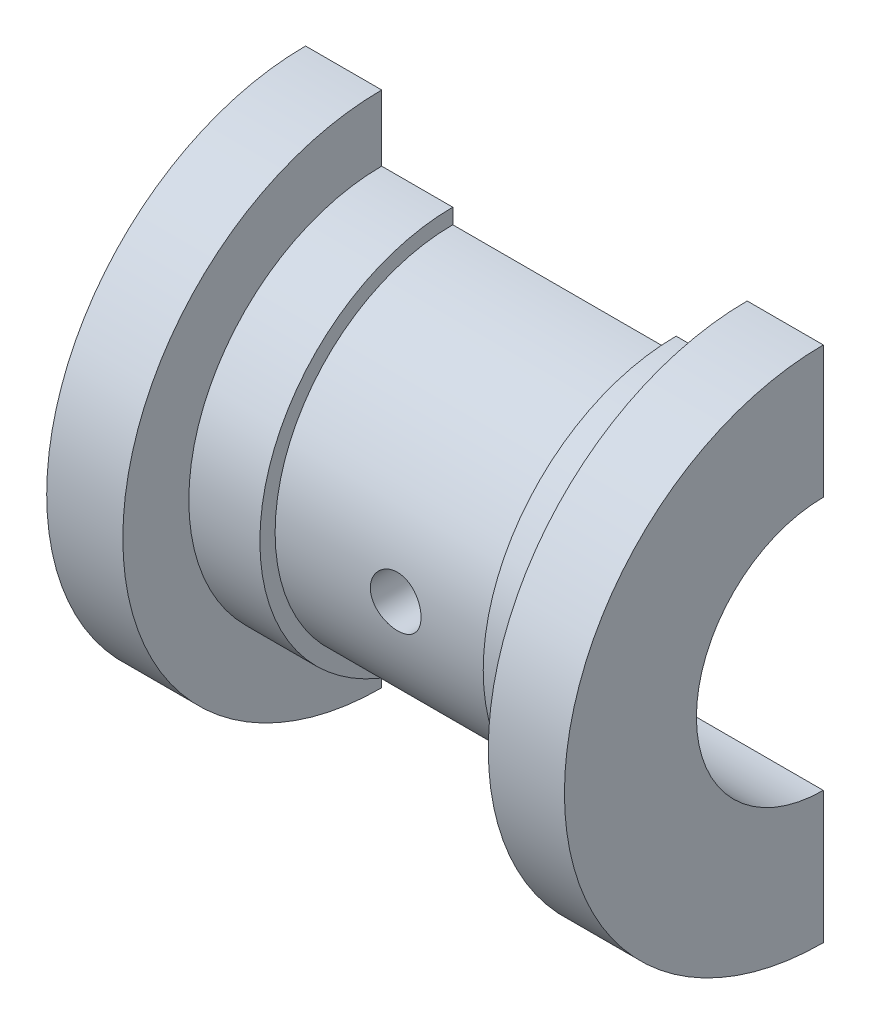
ISO-10303-21;
HEADER;
FILE_DESCRIPTION(('STEP AP214'),'2;1');
FILE_NAME('part.step','',(''),(''),'','','');
FILE_SCHEMA(('AUTOMOTIVE_DESIGN { 1 0 10303 214 1 1 1 1 }'));
ENDSEC;
DATA;
#1=APPLICATION_CONTEXT('core data for automotive mechanical design processes');
#2=APPLICATION_PROTOCOL_DEFINITION('international standard','automotive_design',2000,#1);
#3=PRODUCT_CONTEXT('',#1,'mechanical');
#4=PRODUCT('Part','Part','',(#3));
#5=PRODUCT_RELATED_PRODUCT_CATEGORY('part','',(#4));
#6=PRODUCT_DEFINITION_FORMATION('','',#4);
#7=PRODUCT_DEFINITION_CONTEXT('part definition',#1,'design');
#8=PRODUCT_DEFINITION('design','',#6,#7);
#9=PRODUCT_DEFINITION_SHAPE('','',#8);
#10=(LENGTH_UNIT() NAMED_UNIT(*) SI_UNIT(.MILLI.,.METRE.));
#11=(NAMED_UNIT(*) PLANE_ANGLE_UNIT() SI_UNIT($,.RADIAN.));
#12=(NAMED_UNIT(*) SI_UNIT($,.STERADIAN.) SOLID_ANGLE_UNIT());
#13=UNCERTAINTY_MEASURE_WITH_UNIT(LENGTH_MEASURE(1.E-05),#10,'distance_accuracy_value','');
#14=(GEOMETRIC_REPRESENTATION_CONTEXT(3) GLOBAL_UNCERTAINTY_ASSIGNED_CONTEXT((#13)) GLOBAL_UNIT_ASSIGNED_CONTEXT((#10,
#11,#12)) REPRESENTATION_CONTEXT('',''));
#15=CARTESIAN_POINT('',(0.,0.,0.));
#16=DIRECTION('',(0.,0.,1.));
#17=DIRECTION('',(1.,0.,0.));
#18=AXIS2_PLACEMENT_3D('',#15,#16,#17);
#19=CARTESIAN_POINT('',(0.,0.,0.));
#20=DIRECTION('',(0.,0.,1.));
#21=DIRECTION('',(-1.,0.,0.));
#22=AXIS2_PLACEMENT_3D('',#19,#20,#21);
#23=PLANE('',#22);
#24=DIRECTION('',(0.,-1.,0.));
#25=VECTOR('',#24,1.);
#26=CARTESIAN_POINT('',(51.,-25.5,-1.78065548281E-13));
#27=LINE('',#26,#25);
#28=CARTESIAN_POINT('',(51.,25.5,0.));
#29=VERTEX_POINT('',#28);
#30=CARTESIAN_POINT('',(51.,12.5,0.));
#31=VERTEX_POINT('',#30);
#32=EDGE_CURVE('E133',#29,#31,#27,.T.);
#33=ORIENTED_EDGE('',*,*,#32,.T.);
#34=DIRECTION('',(-1.,0.,0.));
#35=VECTOR('',#34,1.);
#36=CARTESIAN_POINT('',(51.,12.5,0.));
#37=LINE('',#36,#35);
#38=CARTESIAN_POINT('',(0.,12.5,0.));
#39=VERTEX_POINT('',#38);
#40=EDGE_CURVE('E120',#31,#39,#37,.T.);
#41=ORIENTED_EDGE('',*,*,#40,.T.);
#42=DIRECTION('',(0.,1.,0.));
#43=VECTOR('',#42,1.);
#44=CARTESIAN_POINT('',(0.,0.,0.));
#45=LINE('',#44,#43);
#46=CARTESIAN_POINT('',(0.,25.5,0.));
#47=VERTEX_POINT('',#46);
#48=EDGE_CURVE('E172',#39,#47,#45,.T.);
#49=ORIENTED_EDGE('',*,*,#48,.T.);
#50=DIRECTION('',(-1.,0.,0.));
#51=VECTOR('',#50,1.);
#52=CARTESIAN_POINT('',(0.,25.5,0.));
#53=LINE('',#52,#51);
#54=CARTESIAN_POINT('',(7.5,25.5,0.));
#55=VERTEX_POINT('',#54);
#56=EDGE_CURVE('E146',#55,#47,#53,.T.);
#57=ORIENTED_EDGE('',*,*,#56,.F.);
#58=DIRECTION('',(0.,1.,0.));
#59=VECTOR('',#58,1.);
#60=CARTESIAN_POINT('',(7.5,25.5,0.));
#61=LINE('',#60,#59);
#62=CARTESIAN_POINT('',(7.5,19.,0.));
#63=VERTEX_POINT('',#62);
#64=EDGE_CURVE('E197',#63,#55,#61,.T.);
#65=ORIENTED_EDGE('',*,*,#64,.F.);
#66=DIRECTION('',(-1.,0.,0.));
#67=VECTOR('',#66,1.);
#68=CARTESIAN_POINT('',(7.5,19.,0.));
#69=LINE('',#68,#67);
#70=CARTESIAN_POINT('',(14.5,19.,0.));
#71=VERTEX_POINT('',#70);
#72=EDGE_CURVE('E201',#71,#63,#69,.T.);
#73=ORIENTED_EDGE('',*,*,#72,.F.);
#74=DIRECTION('',(0.,1.,0.));
#75=VECTOR('',#74,1.);
#76=CARTESIAN_POINT('',(14.5,19.,0.));
#77=LINE('',#76,#75);
#78=CARTESIAN_POINT('',(14.5,17.5,0.));
#79=VERTEX_POINT('',#78);
#80=EDGE_CURVE('E212',#79,#71,#77,.T.);
#81=ORIENTED_EDGE('',*,*,#80,.F.);
#82=DIRECTION('',(-1.,0.,0.));
#83=VECTOR('',#82,1.);
#84=CARTESIAN_POINT('',(14.5,17.5,0.));
#85=LINE('',#84,#83);
#86=CARTESIAN_POINT('',(36.5,17.5,0.));
#87=VERTEX_POINT('',#86);
#88=EDGE_CURVE('E214',#87,#79,#85,.T.);
#89=ORIENTED_EDGE('',*,*,#88,.F.);
#90=DIRECTION('',(0.,-1.,0.));
#91=VECTOR('',#90,1.);
#92=CARTESIAN_POINT('',(36.5,17.5,0.));
#93=LINE('',#92,#91);
#94=CARTESIAN_POINT('',(36.5,19.,0.));
#95=VERTEX_POINT('',#94);
#96=EDGE_CURVE('E219',#95,#87,#93,.T.);
#97=ORIENTED_EDGE('',*,*,#96,.F.);
#98=DIRECTION('',(-1.,0.,0.));
#99=VECTOR('',#98,1.);
#100=CARTESIAN_POINT('',(36.5,19.,0.));
#101=LINE('',#100,#99);
#102=CARTESIAN_POINT('',(43.5,19.,0.));
#103=VERTEX_POINT('',#102);
#104=EDGE_CURVE('E222',#103,#95,#101,.T.);
#105=ORIENTED_EDGE('',*,*,#104,.F.);
#106=DIRECTION('',(0.,-1.,0.));
#107=VECTOR('',#106,1.);
#108=CARTESIAN_POINT('',(43.5,19.,0.));
#109=LINE('',#108,#107);
#110=CARTESIAN_POINT('',(43.5,25.5,0.));
#111=VERTEX_POINT('',#110);
#112=EDGE_CURVE('E225',#111,#103,#109,.T.);
#113=ORIENTED_EDGE('',*,*,#112,.F.);
#114=DIRECTION('',(-1.,0.,0.));
#115=VECTOR('',#114,1.);
#116=CARTESIAN_POINT('',(43.5,25.5,0.));
#117=LINE('',#116,#115);
#118=EDGE_CURVE('E140',#29,#111,#117,.T.);
#119=ORIENTED_EDGE('',*,*,#118,.F.);
#120=EDGE_LOOP('',(#33,#41,#49,#57,#65,#73,#81,#89,#97,#105,#113,#119));
#121=FACE_BOUND('',#120,.T.);
#122=ADVANCED_FACE('F33',(#121),#23,.F.);
#123=CARTESIAN_POINT('',(0.,0.,0.));
#124=DIRECTION('',(1.,0.,0.));
#125=DIRECTION('',(0.,0.,-1.));
#126=AXIS2_PLACEMENT_3D('',#123,#124,#125);
#127=PLANE('',#126);
#128=ORIENTED_EDGE('',*,*,#48,.F.);
#129=CARTESIAN_POINT('',(0.,0.,0.));
#130=DIRECTION('',(-1.,0.,0.));
#131=DIRECTION('',(0.,0.,1.));
#132=AXIS2_PLACEMENT_3D('',#129,#130,#131);
#133=CIRCLE('',#132,12.5);
#134=CARTESIAN_POINT('',(0.,-12.5,-1.32676290876039E-13));
#135=VERTEX_POINT('',#134);
#136=EDGE_CURVE('E123',#135,#39,#133,.T.);
#137=ORIENTED_EDGE('',*,*,#136,.F.);
#138=CARTESIAN_POINT('',(0.,-25.5,-1.78065548281E-13));
#139=VERTEX_POINT('',#138);
#140=EDGE_CURVE('E173',#139,#135,#45,.T.);
#141=ORIENTED_EDGE('',*,*,#140,.F.);
#142=CARTESIAN_POINT('',(0.,0.,0.));
#143=DIRECTION('',(-1.,0.,0.));
#144=DIRECTION('',(0.,0.,1.));
#145=AXIS2_PLACEMENT_3D('',#142,#143,#144);
#146=CIRCLE('',#145,25.5);
#147=EDGE_CURVE('E11',#139,#47,#146,.T.);
#148=ORIENTED_EDGE('',*,*,#147,.T.);
#149=EDGE_LOOP('',(#128,#137,#141,#148));
#150=FACE_BOUND('',#149,.T.);
#151=ADVANCED_FACE('F35',(#150),#127,.F.);
#152=CARTESIAN_POINT('',(0.,0.,0.));
#153=DIRECTION('',(-1.,0.,0.));
#154=DIRECTION('',(0.,0.,1.));
#155=AXIS2_PLACEMENT_3D('',#152,#153,#154);
#156=CYLINDRICAL_SURFACE('',#155,25.5);
#157=CARTESIAN_POINT('',(7.5,0.,0.));
#158=DIRECTION('',(-1.,0.,0.));
#159=DIRECTION('',(0.,0.,1.));
#160=AXIS2_PLACEMENT_3D('',#157,#158,#159);
#161=CIRCLE('',#160,25.5);
#162=CARTESIAN_POINT('',(7.5,-25.5,-1.78065548281E-13));
#163=VERTEX_POINT('',#162);
#164=EDGE_CURVE('E41',#163,#55,#161,.T.);
#165=ORIENTED_EDGE('',*,*,#164,.T.);
#166=ORIENTED_EDGE('',*,*,#56,.T.);
#167=ORIENTED_EDGE('',*,*,#147,.F.);
#168=DIRECTION('',(-1.,0.,0.));
#169=VECTOR('',#168,1.);
#170=CARTESIAN_POINT('',(0.,-25.5,-1.78065548281E-13));
#171=LINE('',#170,#169);
#172=EDGE_CURVE('E170',#163,#139,#171,.T.);
#173=ORIENTED_EDGE('',*,*,#172,.F.);
#174=EDGE_LOOP('',(#165,#166,#167,#173));
#175=FACE_BOUND('',#174,.T.);
#176=ADVANCED_FACE('F192',(#175),#156,.T.);
#177=CARTESIAN_POINT('',(7.5,-25.5,-1.78065548281E-13));
#178=DIRECTION('',(-1.,0.,0.));
#179=DIRECTION('',(0.,0.,1.));
#180=AXIS2_PLACEMENT_3D('',#177,#178,#179);
#181=PLANE('',#180);
#182=CARTESIAN_POINT('',(7.5,0.,0.));
#183=DIRECTION('',(-1.,0.,0.));
#184=DIRECTION('',(0.,0.,1.));
#185=AXIS2_PLACEMENT_3D('',#182,#183,#184);
#186=CIRCLE('',#185,19.);
#187=CARTESIAN_POINT('',(7.5,-19.,-1.32676290876039E-13));
#188=VERTEX_POINT('',#187);
#189=EDGE_CURVE('E190',#188,#63,#186,.T.);
#190=ORIENTED_EDGE('',*,*,#189,.T.);
#191=ORIENTED_EDGE('',*,*,#64,.T.);
#192=ORIENTED_EDGE('',*,*,#164,.F.);
#193=DIRECTION('',(0.,-1.,0.));
#194=VECTOR('',#193,1.);
#195=CARTESIAN_POINT('',(7.5,-25.5,-1.78065548281E-13));
#196=LINE('',#195,#194);
#197=EDGE_CURVE('E167',#188,#163,#196,.T.);
#198=ORIENTED_EDGE('',*,*,#197,.F.);
#199=EDGE_LOOP('',(#190,#191,#192,#198));
#200=FACE_BOUND('',#199,.T.);
#201=ADVANCED_FACE('F198',(#200),#181,.F.);
#202=CARTESIAN_POINT('',(0.,0.,0.));
#203=DIRECTION('',(-1.,0.,0.));
#204=DIRECTION('',(0.,0.,1.));
#205=AXIS2_PLACEMENT_3D('',#202,#203,#204);
#206=CYLINDRICAL_SURFACE('',#205,19.);
#207=CARTESIAN_POINT('',(14.5,0.,0.));
#208=DIRECTION('',(-1.,0.,0.));
#209=DIRECTION('',(0.,0.,1.));
#210=AXIS2_PLACEMENT_3D('',#207,#208,#209);
#211=CIRCLE('',#210,19.);
#212=CARTESIAN_POINT('',(14.5,-19.,-1.32676290876039E-13));
#213=VERTEX_POINT('',#212);
#214=EDGE_CURVE('E188',#213,#71,#211,.T.);
#215=ORIENTED_EDGE('',*,*,#214,.T.);
#216=ORIENTED_EDGE('',*,*,#72,.T.);
#217=ORIENTED_EDGE('',*,*,#189,.F.);
#218=DIRECTION('',(-1.,0.,0.));
#219=VECTOR('',#218,1.);
#220=CARTESIAN_POINT('',(7.5,-19.,-1.32676290876039E-13));
#221=LINE('',#220,#219);
#222=EDGE_CURVE('E164',#213,#188,#221,.T.);
#223=ORIENTED_EDGE('',*,*,#222,.F.);
#224=EDGE_LOOP('',(#215,#216,#217,#223));
#225=FACE_BOUND('',#224,.T.);
#226=ADVANCED_FACE('F209',(#225),#206,.T.);
#227=CARTESIAN_POINT('',(14.5,-19.,-1.32676290876039E-13));
#228=DIRECTION('',(-1.,0.,0.));
#229=DIRECTION('',(0.,0.,1.));
#230=AXIS2_PLACEMENT_3D('',#227,#228,#229);
#231=PLANE('',#230);
#232=CARTESIAN_POINT('',(14.5,0.,0.));
#233=DIRECTION('',(-1.,0.,0.));
#234=DIRECTION('',(0.,0.,1.));
#235=AXIS2_PLACEMENT_3D('',#232,#233,#234);
#236=CIRCLE('',#235,17.5);
#237=CARTESIAN_POINT('',(14.5,-17.5,-1.2220184685951E-13));
#238=VERTEX_POINT('',#237);
#239=EDGE_CURVE('E186',#238,#79,#236,.T.);
#240=ORIENTED_EDGE('',*,*,#239,.T.);
#241=ORIENTED_EDGE('',*,*,#80,.T.);
#242=ORIENTED_EDGE('',*,*,#214,.F.);
#243=DIRECTION('',(0.,-1.,0.));
#244=VECTOR('',#243,1.);
#245=CARTESIAN_POINT('',(14.5,-19.,-1.32676290876039E-13));
#246=LINE('',#245,#244);
#247=EDGE_CURVE('E161',#238,#213,#246,.T.);
#248=ORIENTED_EDGE('',*,*,#247,.F.);
#249=EDGE_LOOP('',(#240,#241,#242,#248));
#250=FACE_BOUND('',#249,.T.);
#251=ADVANCED_FACE('F287',(#250),#231,.F.);
#252=CARTESIAN_POINT('',(0.,0.,0.));
#253=DIRECTION('',(-1.,0.,0.));
#254=DIRECTION('',(0.,0.,1.));
#255=AXIS2_PLACEMENT_3D('',#252,#253,#254);
#256=CYLINDRICAL_SURFACE('',#255,17.5);
#257=CARTESIAN_POINT('',(26.3759488414896,2.45953483571253,17.3263004819816));
#258=CARTESIAN_POINT('',(26.5156040555402,2.45952900693248,17.3263027141133));
#259=CARTESIAN_POINT('',(26.6553422324551,2.44778918600555,17.3279803743039));
#260=CARTESIAN_POINT('',(26.9309171370185,2.40114976693342,17.3345035382439));
#261=CARTESIAN_POINT('',(27.0667498358835,2.366227089398,17.3393521987699));
#262=CARTESIAN_POINT('',(27.3304847165257,2.27428435209038,17.3516502886351));
#263=CARTESIAN_POINT('',(27.4583926891153,2.21728065379523,17.3590977918935));
#264=CARTESIAN_POINT('',(27.7028110033247,2.08283302044744,17.3757409495992));
#265=CARTESIAN_POINT('',(27.81932302529,2.00539210513135,17.3849363457273));
#266=CARTESIAN_POINT('',(28.0385092112988,1.83166823199903,17.4040988235006));
#267=CARTESIAN_POINT('',(28.141088483822,1.73526604628586,17.414070533565));
#268=CARTESIAN_POINT('',(28.3286757880403,1.52661550268788,17.4335998157096));
#269=CARTESIAN_POINT('',(28.41368288229,1.41436629992924,17.4431573656736));
#270=CARTESIAN_POINT('',(28.5640602136892,1.17660512221691,17.4608089872461));
#271=CARTESIAN_POINT('',(28.6293434846377,1.05103761603123,17.468896516628));
#272=CARTESIAN_POINT('',(28.7378622606494,0.790586076811622,17.482618789293));
#273=CARTESIAN_POINT('',(28.7810988247989,0.655702491659733,17.4882536503961));
#274=CARTESIAN_POINT('',(28.8440103501949,0.38142447066997,17.4963768130846));
#275=CARTESIAN_POINT('',(28.8638439289474,0.242067055567402,17.4988863038848));
#276=CARTESIAN_POINT('',(28.8798787146979,-0.03801697176481,17.5005188848321));
#277=CARTESIAN_POINT('',(28.8760811189473,-0.178743514268221,17.4996421465403));
#278=CARTESIAN_POINT('',(28.8450871187198,-0.456489967713784,17.4945927975786));
#279=CARTESIAN_POINT('',(28.8180613428865,-0.593529410590617,17.490444239182));
#280=CARTESIAN_POINT('',(28.7416456418656,-0.861101137997902,17.4793148387697));
#281=CARTESIAN_POINT('',(28.6922551852549,-0.991633267821595,17.4723339294529));
#282=CARTESIAN_POINT('',(28.5723354105102,-1.2430062818634,17.4562558845256));
#283=CARTESIAN_POINT('',(28.5017336525911,-1.36381212741635,17.4471515212223));
#284=CARTESIAN_POINT('',(28.3414482255643,-1.59192312780241,17.427819863862));
#285=CARTESIAN_POINT('',(28.2517634156856,-1.69922747491522,17.4175925026908));
#286=CARTESIAN_POINT('',(28.0549055893946,-1.89829600254012,17.3970283627142));
#287=CARTESIAN_POINT('',(27.9475836755531,-1.98991298462221,17.386691421835));
#288=CARTESIAN_POINT('',(27.7190056897028,-2.15386052717642,17.3671449289717));
#289=CARTESIAN_POINT('',(27.5977495463076,-2.22619098883568,17.357935382764));
#290=CARTESIAN_POINT('',(27.3445984791069,-2.34953045953439,17.3416722988016));
#291=CARTESIAN_POINT('',(27.2126965841364,-2.400525360025,17.3346201885186));
#292=CARTESIAN_POINT('',(26.9420768667073,-2.47960486117689,17.3234860647053));
#293=CARTESIAN_POINT('',(26.8033594785002,-2.50769091948104,17.3194038622076));
#294=CARTESIAN_POINT('',(26.5243531697021,-2.53995659353789,17.314701504181));
#295=CARTESIAN_POINT('',(26.3840888089951,-2.54434434171043,17.3140512087981));
#296=CARTESIAN_POINT('',(26.1048265852082,-2.52964029801616,17.3162055029355));
#297=CARTESIAN_POINT('',(25.9658286867105,-2.51054916479826,17.3190099955393));
#298=CARTESIAN_POINT('',(25.6936836164541,-2.44960487885065,17.327734036113));
#299=CARTESIAN_POINT('',(25.5605129326579,-2.40785453419812,17.3336395105845));
#300=CARTESIAN_POINT('',(25.303062844669,-2.30288242987066,17.3478967483317));
#301=CARTESIAN_POINT('',(25.1787838420375,-2.23965970121163,17.3562486220039));
#302=CARTESIAN_POINT('',(24.9417089918378,-2.09303227279728,17.3745414673763));
#303=CARTESIAN_POINT('',(24.8289976399742,-2.00949228635397,17.3844929330229));
#304=CARTESIAN_POINT('',(24.6191241869577,-1.82478880308955,17.4048486608654));
#305=CARTESIAN_POINT('',(24.5219628814157,-1.72362440507641,17.4152529461951));
#306=CARTESIAN_POINT('',(24.3452048184474,-1.50562731269021,17.4354562814176));
#307=CARTESIAN_POINT('',(24.2657456885902,-1.38868247818142,17.4452501896655));
#308=CARTESIAN_POINT('',(24.12760438757,-1.14298034380771,17.4630680649159));
#309=CARTESIAN_POINT('',(24.0689216918172,-1.0142233422947,17.4710920766052));
#310=CARTESIAN_POINT('',(23.974221198595,-0.748988277872155,17.4844666385686));
#311=CARTESIAN_POINT('',(23.9381268557053,-0.612538017996304,17.4898262050421));
#312=CARTESIAN_POINT('',(23.8893795076064,-0.335428873410545,17.4973337079228));
#313=CARTESIAN_POINT('',(23.8767251041723,-0.194770240244584,17.4994818358952));
#314=CARTESIAN_POINT('',(23.875248542809,0.0854257222964283,17.5003473820082));
#315=CARTESIAN_POINT('',(23.8862153177165,0.224961891898557,17.4990951579289));
#316=CARTESIAN_POINT('',(23.9312190290434,0.500192479436982,17.4933919091334));
#317=CARTESIAN_POINT('',(23.9652559109945,0.635886906442799,17.4889408919696));
#318=CARTESIAN_POINT('',(24.0553613132748,0.899532358840496,17.4773641411249));
#319=CARTESIAN_POINT('',(24.1114165670952,1.02748799353691,17.4702400181592));
#320=CARTESIAN_POINT('',(24.2439452779925,1.27221514509617,17.4541263394835));
#321=CARTESIAN_POINT('',(24.3204192728134,1.38898636729835,17.445136734646));
#322=CARTESIAN_POINT('',(24.4923834855177,1.60910155594845,17.4262192760321));
#323=CARTESIAN_POINT('',(24.588029975026,1.71232281568493,17.4162840895913));
#324=CARTESIAN_POINT('',(24.795295791788,1.90132790653327,17.3966664959384));
#325=CARTESIAN_POINT('',(24.9069188702512,1.98710763099316,17.3869841487246));
#326=CARTESIAN_POINT('',(25.1436306393957,2.13917842187054,17.3689328115498));
#327=CARTESIAN_POINT('',(25.268784704449,2.20536852043436,17.3605707261013));
#328=CARTESIAN_POINT('',(25.5284892121905,2.31568673782088,17.3462018015973));
#329=CARTESIAN_POINT('',(25.6630295893721,2.35983808792595,17.3401924839114));
#330=CARTESIAN_POINT('',(25.8944943737851,2.41463562094546,17.3326286980138));
#331=CARTESIAN_POINT('',(25.9899792607548,2.43144752287153,17.3302681089011));
#332=CARTESIAN_POINT('',(26.1822790876949,2.45389908907045,17.3271032355537));
#333=CARTESIAN_POINT('',(26.2790940127967,2.45953887813585,17.3262989339354));
#334=CARTESIAN_POINT('',(26.3759488414896,2.45953483571253,17.3263004819816));
#335=B_SPLINE_CURVE_WITH_KNOTS('',3,(#257,#258,#259,#260,#261,#262,#263,#264,#265,#266,#267,
#268,#269,#270,#271,#272,#273,#274,#275,#276,#277,#278,#279,#280,#281,#282,#283,#284,#285,#286,
#287,#288,#289,#290,#291,#292,#293,#294,#295,#296,#297,#298,#299,#300,#301,#302,#303,#304,#305,
#306,#307,#308,#309,#310,#311,#312,#313,#314,#315,#316,#317,#318,#319,#320,#321,#322,#323,#324,
#325,#326,#327,#328,#329,#330,#331,#332,#333,#334),.UNSPECIFIED.,.T.,.F.,(4,2,2,2,2,2,2,2,2,2,2,
2,2,2,2,2,2,2,2,2,2,2,2,2,2,2,2,2,2,2,2,2,2,2,2,2,2,2,4),(0.,0.418611686761214,0.83764074315785,
1.25635990174198,1.67501722635384,2.09639644561274,2.51779813893171,2.94103163345004,
3.36424479463775,3.78457277673272,4.20487946347624,4.62212481134302,5.03938007419639,
5.45807684551733,5.87679865326299,6.29925647482804,6.72171646077846,7.14445536663837,
7.56716737238594,7.98616076353199,8.40514240099881,8.82223876005372,9.23935394391405,
9.65932651264328,10.0793205622075,10.5024740190271,10.9256167907707,11.3473177767363,
11.7689936068438,12.1869171913008,12.6048397890487,13.022510965389,13.4401931425248,
13.8614293663583,14.2827646567287,14.7062351939404,15.1292583986304,15.4195806495844,
15.7098996576198),.UNSPECIFIED.);
#336=CARTESIAN_POINT('',(26.3759488414896,2.45953483571253,17.3263004819816));
#337=VERTEX_POINT('',#336);
#338=EDGE_CURVE('E238',#337,#337,#335,.T.);
#339=ORIENTED_EDGE('',*,*,#338,.T.);
#340=EDGE_LOOP('',(#339));
#341=FACE_BOUND('',#340,.T.);
#342=CARTESIAN_POINT('',(36.5,0.,0.));
#343=DIRECTION('',(-1.,0.,0.));
#344=DIRECTION('',(0.,0.,1.));
#345=AXIS2_PLACEMENT_3D('',#342,#343,#344);
#346=CIRCLE('',#345,17.5);
#347=CARTESIAN_POINT('',(36.5,-17.5,-1.2220184685951E-13));
#348=VERTEX_POINT('',#347);
#349=EDGE_CURVE('E184',#348,#87,#346,.T.);
#350=ORIENTED_EDGE('',*,*,#349,.T.);
#351=ORIENTED_EDGE('',*,*,#88,.T.);
#352=ORIENTED_EDGE('',*,*,#239,.F.);
#353=DIRECTION('',(-1.,0.,0.));
#354=VECTOR('',#353,1.);
#355=CARTESIAN_POINT('',(14.5,-17.5,-1.2220184685951E-13));
#356=LINE('',#355,#354);
#357=EDGE_CURVE('E158',#348,#238,#356,.T.);
#358=ORIENTED_EDGE('',*,*,#357,.F.);
#359=EDGE_LOOP('',(#350,#351,#352,#358));
#360=FACE_BOUND('',#359,.T.);
#361=ADVANCED_FACE('F282',(#341,#360),#256,.T.);
#362=CARTESIAN_POINT('',(36.5,-17.5,-1.2220184685951E-13));
#363=DIRECTION('',(1.,0.,0.));
#364=DIRECTION('',(0.,0.,-1.));
#365=AXIS2_PLACEMENT_3D('',#362,#363,#364);
#366=PLANE('',#365);
#367=CARTESIAN_POINT('',(36.5,0.,0.));
#368=DIRECTION('',(-1.,0.,0.));
#369=DIRECTION('',(0.,0.,1.));
#370=AXIS2_PLACEMENT_3D('',#367,#368,#369);
#371=CIRCLE('',#370,19.);
#372=CARTESIAN_POINT('',(36.5,-19.,-1.32676290876039E-13));
#373=VERTEX_POINT('',#372);
#374=EDGE_CURVE('E182',#373,#95,#371,.T.);
#375=ORIENTED_EDGE('',*,*,#374,.T.);
#376=ORIENTED_EDGE('',*,*,#96,.T.);
#377=ORIENTED_EDGE('',*,*,#349,.F.);
#378=DIRECTION('',(0.,1.,0.));
#379=VECTOR('',#378,1.);
#380=CARTESIAN_POINT('',(36.5,-17.5,-1.2220184685951E-13));
#381=LINE('',#380,#379);
#382=EDGE_CURVE('E155',#373,#348,#381,.T.);
#383=ORIENTED_EDGE('',*,*,#382,.F.);
#384=EDGE_LOOP('',(#375,#376,#377,#383));
#385=FACE_BOUND('',#384,.T.);
#386=ADVANCED_FACE('F279',(#385),#366,.F.);
#387=CARTESIAN_POINT('',(0.,0.,0.));
#388=DIRECTION('',(-1.,0.,0.));
#389=DIRECTION('',(0.,0.,1.));
#390=AXIS2_PLACEMENT_3D('',#387,#388,#389);
#391=CYLINDRICAL_SURFACE('',#390,19.);
#392=CARTESIAN_POINT('',(43.5,0.,0.));
#393=DIRECTION('',(-1.,0.,0.));
#394=DIRECTION('',(0.,0.,1.));
#395=AXIS2_PLACEMENT_3D('',#392,#393,#394);
#396=CIRCLE('',#395,19.);
#397=CARTESIAN_POINT('',(43.5,-19.,-1.32676290876039E-13));
#398=VERTEX_POINT('',#397);
#399=EDGE_CURVE('E180',#398,#103,#396,.T.);
#400=ORIENTED_EDGE('',*,*,#399,.T.);
#401=ORIENTED_EDGE('',*,*,#104,.T.);
#402=ORIENTED_EDGE('',*,*,#374,.F.);
#403=DIRECTION('',(-1.,0.,0.));
#404=VECTOR('',#403,1.);
#405=CARTESIAN_POINT('',(36.5,-19.,-1.32676290876039E-13));
#406=LINE('',#405,#404);
#407=EDGE_CURVE('E152',#398,#373,#406,.T.);
#408=ORIENTED_EDGE('',*,*,#407,.F.);
#409=EDGE_LOOP('',(#400,#401,#402,#408));
#410=FACE_BOUND('',#409,.T.);
#411=ADVANCED_FACE('F275',(#410),#391,.T.);
#412=CARTESIAN_POINT('',(43.5,-19.,-1.32676290876039E-13));
#413=DIRECTION('',(1.,0.,0.));
#414=DIRECTION('',(0.,0.,-1.));
#415=AXIS2_PLACEMENT_3D('',#412,#413,#414);
#416=PLANE('',#415);
#417=CARTESIAN_POINT('',(43.5,0.,0.));
#418=DIRECTION('',(-1.,0.,0.));
#419=DIRECTION('',(0.,0.,1.));
#420=AXIS2_PLACEMENT_3D('',#417,#418,#419);
#421=CIRCLE('',#420,25.5);
#422=CARTESIAN_POINT('',(43.5,-25.5,-1.78065548281E-13));
#423=VERTEX_POINT('',#422);
#424=EDGE_CURVE('E178',#423,#111,#421,.T.);
#425=ORIENTED_EDGE('',*,*,#424,.T.);
#426=ORIENTED_EDGE('',*,*,#112,.T.);
#427=ORIENTED_EDGE('',*,*,#399,.F.);
#428=DIRECTION('',(0.,1.,0.));
#429=VECTOR('',#428,1.);
#430=CARTESIAN_POINT('',(43.5,-19.,-1.32676290876039E-13));
#431=LINE('',#430,#429);
#432=EDGE_CURVE('E144',#423,#398,#431,.T.);
#433=ORIENTED_EDGE('',*,*,#432,.F.);
#434=EDGE_LOOP('',(#425,#426,#427,#433));
#435=FACE_BOUND('',#434,.T.);
#436=ADVANCED_FACE('F269',(#435),#416,.F.);
#437=CARTESIAN_POINT('',(0.,0.,0.));
#438=DIRECTION('',(-1.,0.,0.));
#439=DIRECTION('',(0.,0.,1.));
#440=AXIS2_PLACEMENT_3D('',#437,#438,#439);
#441=CYLINDRICAL_SURFACE('',#440,25.5);
#442=CARTESIAN_POINT('',(51.,0.,0.));
#443=DIRECTION('',(-1.,0.,0.));
#444=DIRECTION('',(0.,0.,1.));
#445=AXIS2_PLACEMENT_3D('',#442,#443,#444);
#446=CIRCLE('',#445,25.5);
#447=CARTESIAN_POINT('',(51.,-25.5,-1.78065548281E-13));
#448=VERTEX_POINT('',#447);
#449=EDGE_CURVE('E176',#448,#29,#446,.T.);
#450=ORIENTED_EDGE('',*,*,#449,.T.);
#451=ORIENTED_EDGE('',*,*,#118,.T.);
#452=ORIENTED_EDGE('',*,*,#424,.F.);
#453=DIRECTION('',(-1.,0.,0.));
#454=VECTOR('',#453,1.);
#455=CARTESIAN_POINT('',(43.5,-25.5,-1.78065548281E-13));
#456=LINE('',#455,#454);
#457=EDGE_CURVE('E141',#448,#423,#456,.T.);
#458=ORIENTED_EDGE('',*,*,#457,.F.);
#459=EDGE_LOOP('',(#450,#451,#452,#458));
#460=FACE_BOUND('',#459,.T.);
#461=ADVANCED_FACE('F265',(#460),#441,.T.);
#462=CARTESIAN_POINT('',(51.,-25.5,-1.78065548281E-13));
#463=DIRECTION('',(-1.,0.,0.));
#464=DIRECTION('',(0.,0.,1.));
#465=AXIS2_PLACEMENT_3D('',#462,#463,#464);
#466=PLANE('',#465);
#467=CARTESIAN_POINT('',(51.,-12.5,0.));
#468=VERTEX_POINT('',#467);
#469=EDGE_CURVE('E135',#468,#448,#27,.T.);
#470=ORIENTED_EDGE('',*,*,#469,.F.);
#471=CARTESIAN_POINT('',(51.,0.,0.));
#472=DIRECTION('',(-1.,0.,0.));
#473=DIRECTION('',(0.,0.,1.));
#474=AXIS2_PLACEMENT_3D('',#471,#472,#473);
#475=CIRCLE('',#474,12.5);
#476=EDGE_CURVE('E48',#468,#31,#475,.T.);
#477=ORIENTED_EDGE('',*,*,#476,.T.);
#478=ORIENTED_EDGE('',*,*,#32,.F.);
#479=ORIENTED_EDGE('',*,*,#449,.F.);
#480=EDGE_LOOP('',(#470,#477,#478,#479));
#481=FACE_BOUND('',#480,.T.);
#482=ADVANCED_FACE('F131',(#481),#466,.F.);
#483=ORIENTED_EDGE('',*,*,#140,.T.);
#484=DIRECTION('',(-1.,0.,0.));
#485=VECTOR('',#484,1.);
#486=CARTESIAN_POINT('',(51.,-12.5,-1.32676290876039E-13));
#487=LINE('',#486,#485);
#488=EDGE_CURVE('E127',#468,#135,#487,.T.);
#489=ORIENTED_EDGE('',*,*,#488,.F.);
#490=ORIENTED_EDGE('',*,*,#469,.T.);
#491=ORIENTED_EDGE('',*,*,#457,.T.);
#492=ORIENTED_EDGE('',*,*,#432,.T.);
#493=ORIENTED_EDGE('',*,*,#407,.T.);
#494=ORIENTED_EDGE('',*,*,#382,.T.);
#495=ORIENTED_EDGE('',*,*,#357,.T.);
#496=ORIENTED_EDGE('',*,*,#247,.T.);
#497=ORIENTED_EDGE('',*,*,#222,.T.);
#498=ORIENTED_EDGE('',*,*,#197,.T.);
#499=ORIENTED_EDGE('',*,*,#172,.T.);
#500=EDGE_LOOP('',(#483,#489,#490,#491,#492,#493,#494,#495,#496,#497,#498,#499));
#501=FACE_BOUND('',#500,.T.);
#502=ADVANCED_FACE('F205',(#501),#23,.F.);
#503=CARTESIAN_POINT('',(51.,0.,0.));
#504=DIRECTION('',(-1.,0.,0.));
#505=DIRECTION('',(0.,0.,1.));
#506=AXIS2_PLACEMENT_3D('',#503,#504,#505);
#507=CYLINDRICAL_SURFACE('',#506,12.5);
#508=CARTESIAN_POINT('',(23.8759488414896,-0.0291982947166271,12.4999658983369));
#509=CARTESIAN_POINT('',(23.8759539527355,-0.168140176664292,12.4996387876849));
#510=CARTESIAN_POINT('',(23.8875709489087,-0.307141220151858,12.4969762828805));
#511=CARTESIAN_POINT('',(23.9336950917777,-0.581203833630795,12.4872355945549));
#512=CARTESIAN_POINT('',(23.9682204234934,-0.716262184854062,12.4801539032755));
#513=CARTESIAN_POINT('',(24.0590520255416,-0.978438757936332,12.4623397314207));
#514=CARTESIAN_POINT('',(24.1153374336013,-1.10556444998705,12.4516107488376));
#515=CARTESIAN_POINT('',(24.2480294602679,-1.34855293174232,12.4276438194733));
#516=CARTESIAN_POINT('',(24.3244348805076,-1.46441639167357,12.4144060221326));
#517=CARTESIAN_POINT('',(24.4962950772182,-1.68317182442035,12.3866562659365));
#518=CARTESIAN_POINT('',(24.5919697299676,-1.78588935974164,12.372130796519));
#519=CARTESIAN_POINT('',(24.7991798824689,-1.97393007262764,12.3435273547388));
#520=CARTESIAN_POINT('',(24.9107166198274,-2.05925189166183,12.3294494173987));
#521=CARTESIAN_POINT('',(25.1477393240193,-2.21082396583537,12.3031804268508));
#522=CARTESIAN_POINT('',(25.2733429509805,-2.27689367605478,12.2910077026206));
#523=CARTESIAN_POINT('',(25.5341533889998,-2.38693199216911,12.2701146284636));
#524=CARTESIAN_POINT('',(25.6693592498555,-2.43090278142519,12.2613939374959));
#525=CARTESIAN_POINT('',(25.9436597512594,-2.49493094134104,12.2485257285991));
#526=CARTESIAN_POINT('',(26.0826802018452,-2.5152941675405,12.2443197727809));
#527=CARTESIAN_POINT('',(26.3622233949005,-2.53248001397822,12.2407772431596));
#528=CARTESIAN_POINT('',(26.50274598229,-2.52930504129497,12.2414401714516));
#529=CARTESIAN_POINT('',(26.7790658115421,-2.49975176052285,12.2475081124465));
#530=CARTESIAN_POINT('',(26.9149023555579,-2.47372406535947,12.2528414669062));
#531=CARTESIAN_POINT('',(27.1802390331471,-2.39975656206059,12.267541617538));
#532=CARTESIAN_POINT('',(27.3097388637871,-2.35181570747359,12.2769086063329));
#533=CARTESIAN_POINT('',(27.5597369957486,-2.23504614966506,12.2987032521143));
#534=CARTESIAN_POINT('',(27.6801685404125,-2.1660784570389,12.3111511680275));
#535=CARTESIAN_POINT('',(27.9078759664217,-2.00930861536591,12.3377056574188));
#536=CARTESIAN_POINT('',(28.0151503336175,-1.92150430176069,12.3518124214346));
#537=CARTESIAN_POINT('',(28.215522347632,-1.72767353050999,12.3804236968061));
#538=CARTESIAN_POINT('',(28.3083302611374,-1.62134769367853,12.3949307982691));
#539=CARTESIAN_POINT('',(28.4748334572427,-1.39448362460634,12.422497784579));
#540=CARTESIAN_POINT('',(28.5485284947236,-1.27394521012093,12.4355576508643));
#541=CARTESIAN_POINT('',(28.6747676145546,-1.02175334583989,12.4588145669004));
#542=CARTESIAN_POINT('',(28.727278575601,-0.890082876819179,12.4690071261444));
#543=CARTESIAN_POINT('',(28.809350026586,-0.619538257311394,12.4853721296028));
#544=CARTESIAN_POINT('',(28.8389132966737,-0.480664981631202,12.4915450607867));
#545=CARTESIAN_POINT('',(28.8738399759753,-0.202145325054057,12.4991287120557));
#546=CARTESIAN_POINT('',(28.8795998903403,-0.0625507282452794,12.5006173596912));
#547=CARTESIAN_POINT('',(28.8678241941342,0.215617165630321,12.4989140492369));
#548=CARTESIAN_POINT('',(28.8502898931081,0.354190519668603,12.4957223542636));
#549=CARTESIAN_POINT('',(28.7927529076297,0.625102388202915,12.4850900150878));
#550=CARTESIAN_POINT('',(28.7529536702449,0.757485760830277,12.4776878342968));
#551=CARTESIAN_POINT('',(28.6522388848501,1.01370816381624,12.459490676652));
#552=CARTESIAN_POINT('',(28.5913217547975,1.13754655319552,12.4486954456142));
#553=CARTESIAN_POINT('',(28.4492426148613,1.37483418005832,12.4247431097707));
#554=CARTESIAN_POINT('',(28.3678418888923,1.48813766879438,12.4115587078884));
#555=CARTESIAN_POINT('',(28.1874258634714,1.699621480546,12.3843722408739));
#556=CARTESIAN_POINT('',(28.0884086754899,1.79780018003791,12.370370088185));
#557=CARTESIAN_POINT('',(27.8737654617618,1.97777557454655,12.3428860758882));
#558=CARTESIAN_POINT('',(27.7579094809363,2.05930004183602,12.3294153860807));
#559=CARTESIAN_POINT('',(27.5139204380979,2.20172726627073,12.3047812985139));
#560=CARTESIAN_POINT('',(27.3857878675557,2.26263084849289,12.2936178084465));
#561=CARTESIAN_POINT('',(27.1215282261157,2.36171339485802,12.2749686426563));
#562=CARTESIAN_POINT('',(26.9854467384638,2.40001017483172,12.267463935431));
#563=CARTESIAN_POINT('',(26.7086152077623,2.45314775949564,12.256949576891));
#564=CARTESIAN_POINT('',(26.5678657759662,2.46799162299058,12.253939339396));
#565=CARTESIAN_POINT('',(26.2884266801288,2.4736881789822,12.2527903661458));
#566=CARTESIAN_POINT('',(26.1497459691721,2.46497120466306,12.2545642482704));
#567=CARTESIAN_POINT('',(25.875869716727,2.42474364572709,12.2625866614497));
#568=CARTESIAN_POINT('',(25.7406741472526,2.39323324420347,12.2688351565611));
#569=CARTESIAN_POINT('',(25.4778795633882,2.30850650085432,12.2850574770036));
#570=CARTESIAN_POINT('',(25.3502629402336,2.25534292503297,12.2950222413202));
#571=CARTESIAN_POINT('',(25.1056895396535,2.12887030473975,12.3175492288731));
#572=CARTESIAN_POINT('',(24.9887336571768,2.05555957102309,12.3301116698905));
#573=CARTESIAN_POINT('',(24.7666599111138,1.8894064435133,12.3566711194176));
#574=CARTESIAN_POINT('',(24.6617769283206,1.7962533769378,12.3706888744665));
#575=CARTESIAN_POINT('',(24.4689833276667,1.59370427942817,12.3984085470863));
#576=CARTESIAN_POINT('',(24.3810766156964,1.48430452068263,12.4121103913357));
#577=CARTESIAN_POINT('',(24.2238622316235,1.25099447717349,12.4378018941123));
#578=CARTESIAN_POINT('',(24.1547588332895,1.12694431625639,12.449772133298));
#579=CARTESIAN_POINT('',(24.0384835349981,0.868789022382253,12.4704415207824));
#580=CARTESIAN_POINT('',(23.9912918676584,0.734693079449319,12.4791436160343));
#581=CARTESIAN_POINT('',(23.9293189713778,0.495378734936098,12.4906005280483));
#582=CARTESIAN_POINT('',(23.9093408572202,0.391520233370282,12.4943062029439));
#583=CARTESIAN_POINT('',(23.8826540605937,0.182053086408258,12.4991132039148));
#584=CARTESIAN_POINT('',(23.8759449552152,0.0764444968990042,12.5002146129935));
#585=CARTESIAN_POINT('',(23.8759488414896,-0.0291982947166271,12.4999658983369));
#586=B_SPLINE_CURVE_WITH_KNOTS('',3,(#508,#509,#510,#511,#512,#513,#514,#515,#516,#517,#518,
#519,#520,#521,#522,#523,#524,#525,#526,#527,#528,#529,#530,#531,#532,#533,#534,#535,#536,#537,
#538,#539,#540,#541,#542,#543,#544,#545,#546,#547,#548,#549,#550,#551,#552,#553,#554,#555,#556,
#557,#558,#559,#560,#561,#562,#563,#564,#565,#566,#567,#568,#569,#570,#571,#572,#573,#574,#575,
#576,#577,#578,#579,#580,#581,#582,#583,#584,#585),.UNSPECIFIED.,.T.,.F.,(4,2,2,2,2,2,2,2,2,2,2,
2,2,2,2,2,2,2,2,2,2,2,2,2,2,2,2,2,2,2,2,2,2,2,2,2,2,2,4),(0.,0.416440326653146,
0.833211626728307,1.24958433812585,1.66593225557716,2.08733167528046,2.50876399186841,
2.93402987514806,3.35925373412993,3.77890462758968,4.19851260703062,4.61179317515695,
5.02509348134324,5.4411872550898,5.85732886874176,6.28095631228376,6.7045891884955,
7.12888187135059,7.55312314245089,7.97026839190663,8.38739019144668,8.80076134876808,
9.21416348040055,9.63262665083395,10.0511347086482,10.4760157144806,10.9008797180867,
11.3235095258181,11.7460842082604,12.1609930641925,12.5758985873152,12.9897990313277,
13.4037341895467,13.8247019059786,14.2457663633233,14.6712374168909,15.096323887938,
15.4129693822473,15.7296047842749),.UNSPECIFIED.);
#587=CARTESIAN_POINT('',(23.8759488414896,-0.0291982947166271,12.4999658983369));
#588=VERTEX_POINT('',#587);
#589=EDGE_CURVE('E230',#588,#588,#586,.T.);
#590=ORIENTED_EDGE('',*,*,#589,.T.);
#591=EDGE_LOOP('',(#590));
#592=FACE_BOUND('',#591,.T.);
#593=ORIENTED_EDGE('',*,*,#136,.T.);
#594=ORIENTED_EDGE('',*,*,#40,.F.);
#595=ORIENTED_EDGE('',*,*,#476,.F.);
#596=ORIENTED_EDGE('',*,*,#488,.T.);
#597=EDGE_LOOP('',(#593,#594,#595,#596));
#598=FACE_BOUND('',#597,.T.);
#599=ADVANCED_FACE('F121',(#592,#598),#507,.F.);
#600=CARTESIAN_POINT('',(26.3759488414896,-0.0291982947166203,12.4999658983369));
#601=DIRECTION('',(0.,0.00233586357733017,-0.999997271866953));
#602=DIRECTION('',(0.,0.999997271866953,0.00233586357733017));
#603=AXIS2_PLACEMENT_3D('',#600,#601,#602);
#604=CYLINDRICAL_SURFACE('',#603,2.5);
#605=ORIENTED_EDGE('',*,*,#589,.F.);
#606=EDGE_LOOP('',(#605));
#607=FACE_BOUND('',#606,.T.);
#608=ORIENTED_EDGE('',*,*,#338,.F.);
#609=EDGE_LOOP('',(#608));
#610=FACE_BOUND('',#609,.T.);
#611=ADVANCED_FACE('F244',(#607,#610),#604,.F.);
#612=CLOSED_SHELL('',(#122,#151,#176,#201,#226,#251,#361,#386,#411,#436,#461,#482,#502,#599,#611));
#613=MANIFOLD_SOLID_BREP('B2',#612);
#614=ADVANCED_BREP_SHAPE_REPRESENTATION('',(#18,#613),#14);
#615=SHAPE_DEFINITION_REPRESENTATION(#9,#614);
ENDSEC;
END-ISO-10303-21;
